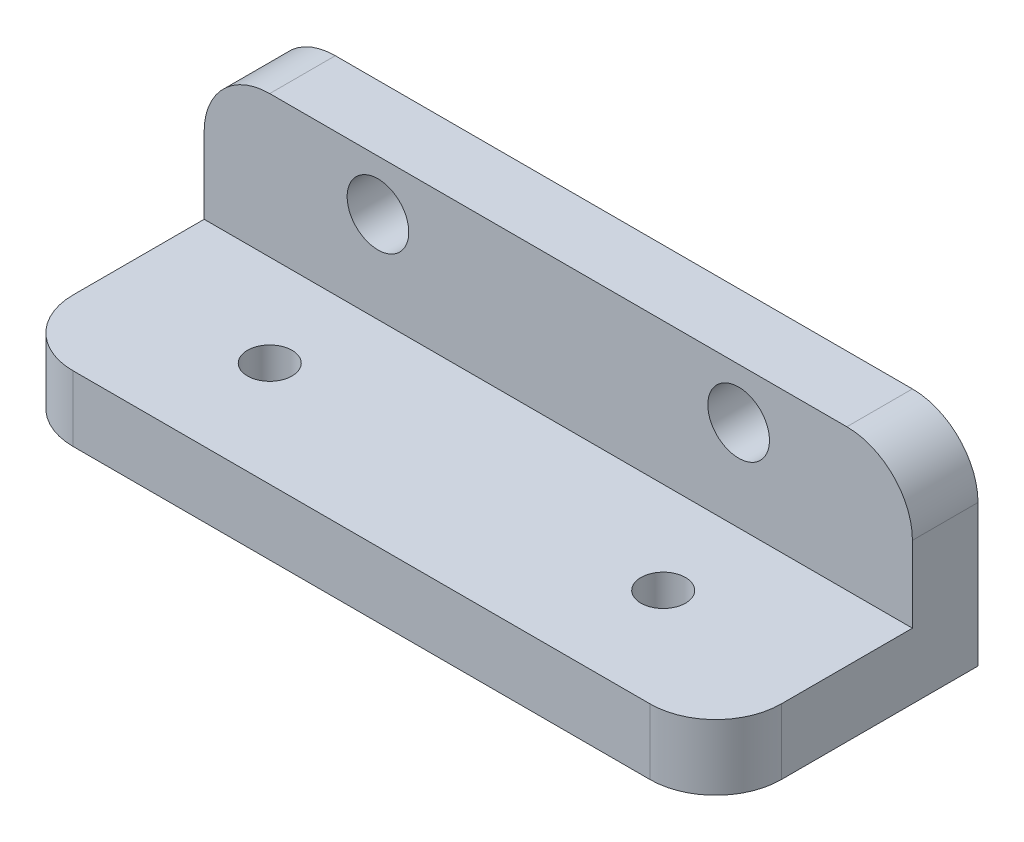
ISO-10303-21;
HEADER;
FILE_DESCRIPTION(('STEP AP214'),'2;1');
FILE_NAME('part.step','',(''),(''),'','','');
FILE_SCHEMA(('AUTOMOTIVE_DESIGN { 1 0 10303 214 1 1 1 1 }'));
ENDSEC;
DATA;
#1=APPLICATION_CONTEXT('core data for automotive mechanical design processes');
#2=APPLICATION_PROTOCOL_DEFINITION('international standard','automotive_design',2000,#1);
#3=PRODUCT_CONTEXT('',#1,'mechanical');
#4=PRODUCT('Part','Part','',(#3));
#5=PRODUCT_RELATED_PRODUCT_CATEGORY('part','',(#4));
#6=PRODUCT_DEFINITION_FORMATION('','',#4);
#7=PRODUCT_DEFINITION_CONTEXT('part definition',#1,'design');
#8=PRODUCT_DEFINITION('design','',#6,#7);
#9=PRODUCT_DEFINITION_SHAPE('','',#8);
#10=(LENGTH_UNIT() NAMED_UNIT(*) SI_UNIT(.MILLI.,.METRE.));
#11=(NAMED_UNIT(*) PLANE_ANGLE_UNIT() SI_UNIT($,.RADIAN.));
#12=(NAMED_UNIT(*) SI_UNIT($,.STERADIAN.) SOLID_ANGLE_UNIT());
#13=UNCERTAINTY_MEASURE_WITH_UNIT(LENGTH_MEASURE(1.E-05),#10,'distance_accuracy_value','');
#14=(GEOMETRIC_REPRESENTATION_CONTEXT(3) GLOBAL_UNCERTAINTY_ASSIGNED_CONTEXT((#13)) GLOBAL_UNIT_ASSIGNED_CONTEXT((#10,
#11,#12)) REPRESENTATION_CONTEXT('',''));
#15=CARTESIAN_POINT('',(0.,0.,0.));
#16=DIRECTION('',(0.,0.,1.));
#17=DIRECTION('',(1.,0.,0.));
#18=AXIS2_PLACEMENT_3D('',#15,#16,#17);
#19=CARTESIAN_POINT('',(-27.,5.,10.));
#20=DIRECTION('',(1.,0.,0.));
#21=DIRECTION('',(0.,0.,-1.));
#22=AXIS2_PLACEMENT_3D('',#19,#20,#21);
#23=PLANE('',#22);
#24=DIRECTION('',(0.,0.,1.));
#25=VECTOR('',#24,1.);
#26=CARTESIAN_POINT('',(-27.,0.,10.));
#27=LINE('',#26,#25);
#28=CARTESIAN_POINT('',(-27.,0.,-10.));
#29=VERTEX_POINT('',#28);
#30=CARTESIAN_POINT('',(-27.,0.,5.));
#31=VERTEX_POINT('',#30);
#32=EDGE_CURVE('E163',#29,#31,#27,.T.);
#33=ORIENTED_EDGE('',*,*,#32,.T.);
#34=DIRECTION('',(0.,-1.,0.));
#35=VECTOR('',#34,1.);
#36=CARTESIAN_POINT('',(-27.,5.,5.));
#37=LINE('',#36,#35);
#38=CARTESIAN_POINT('',(-27.,5.,5.));
#39=VERTEX_POINT('',#38);
#40=EDGE_CURVE('E186',#31,#39,#37,.F.);
#41=ORIENTED_EDGE('',*,*,#40,.T.);
#42=DIRECTION('',(0.,0.,1.));
#43=VECTOR('',#42,1.);
#44=CARTESIAN_POINT('',(-27.,5.,10.));
#45=LINE('',#44,#43);
#46=CARTESIAN_POINT('',(-27.,5.,-5.));
#47=VERTEX_POINT('',#46);
#48=EDGE_CURVE('E151',#47,#39,#45,.T.);
#49=ORIENTED_EDGE('',*,*,#48,.F.);
#50=DIRECTION('',(0.,-1.,0.));
#51=VECTOR('',#50,1.);
#52=CARTESIAN_POINT('',(-27.,15.8,-5.));
#53=LINE('',#52,#51);
#54=CARTESIAN_POINT('',(-27.,10.8,-5.));
#55=VERTEX_POINT('',#54);
#56=EDGE_CURVE('E135',#55,#47,#53,.T.);
#57=ORIENTED_EDGE('',*,*,#56,.F.);
#58=DIRECTION('',(0.,0.,1.));
#59=VECTOR('',#58,1.);
#60=CARTESIAN_POINT('',(-27.,10.8,-10.));
#61=LINE('',#60,#59);
#62=CARTESIAN_POINT('',(-27.,10.8,-10.));
#63=VERTEX_POINT('',#62);
#64=EDGE_CURVE('E182',#55,#63,#61,.F.);
#65=ORIENTED_EDGE('',*,*,#64,.T.);
#66=DIRECTION('',(0.,-1.,0.));
#67=VECTOR('',#66,1.);
#68=CARTESIAN_POINT('',(-27.,5.,-10.));
#69=LINE('',#68,#67);
#70=EDGE_CURVE('E125',#63,#29,#69,.T.);
#71=ORIENTED_EDGE('',*,*,#70,.T.);
#72=EDGE_LOOP('',(#33,#41,#49,#57,#65,#71));
#73=FACE_BOUND('',#72,.T.);
#74=ADVANCED_FACE('F33',(#73),#23,.F.);
#75=CARTESIAN_POINT('',(27.,5.,10.));
#76=DIRECTION('',(0.,0.,-1.));
#77=DIRECTION('',(-1.,0.,0.));
#78=AXIS2_PLACEMENT_3D('',#75,#76,#77);
#79=PLANE('',#78);
#80=DIRECTION('',(1.,0.,0.));
#81=VECTOR('',#80,1.);
#82=CARTESIAN_POINT('',(27.,0.,10.));
#83=LINE('',#82,#81);
#84=CARTESIAN_POINT('',(-22.,0.,10.));
#85=VERTEX_POINT('',#84);
#86=CARTESIAN_POINT('',(22.,0.,10.));
#87=VERTEX_POINT('',#86);
#88=EDGE_CURVE('E245',#85,#87,#83,.T.);
#89=ORIENTED_EDGE('',*,*,#88,.T.);
#90=DIRECTION('',(0.,-1.,0.));
#91=VECTOR('',#90,1.);
#92=CARTESIAN_POINT('',(22.,5.,10.));
#93=LINE('',#92,#91);
#94=CARTESIAN_POINT('',(22.,5.,10.));
#95=VERTEX_POINT('',#94);
#96=EDGE_CURVE('E177',#87,#95,#93,.F.);
#97=ORIENTED_EDGE('',*,*,#96,.T.);
#98=DIRECTION('',(1.,0.,0.));
#99=VECTOR('',#98,1.);
#100=CARTESIAN_POINT('',(27.,5.,10.));
#101=LINE('',#100,#99);
#102=CARTESIAN_POINT('',(-22.,5.,10.));
#103=VERTEX_POINT('',#102);
#104=EDGE_CURVE('E126',#103,#95,#101,.T.);
#105=ORIENTED_EDGE('',*,*,#104,.F.);
#106=DIRECTION('',(0.,-1.,0.));
#107=VECTOR('',#106,1.);
#108=CARTESIAN_POINT('',(-22.,5.,10.));
#109=LINE('',#108,#107);
#110=EDGE_CURVE('E174',#103,#85,#109,.T.);
#111=ORIENTED_EDGE('',*,*,#110,.T.);
#112=EDGE_LOOP('',(#89,#97,#105,#111));
#113=FACE_BOUND('',#112,.T.);
#114=ADVANCED_FACE('F220',(#113),#79,.F.);
#115=CARTESIAN_POINT('',(27.,5.,10.));
#116=DIRECTION('',(-1.,0.,0.));
#117=DIRECTION('',(0.,0.,1.));
#118=AXIS2_PLACEMENT_3D('',#115,#116,#117);
#119=PLANE('',#118);
#120=DIRECTION('',(0.,0.,-1.));
#121=VECTOR('',#120,1.);
#122=CARTESIAN_POINT('',(27.,5.,10.));
#123=LINE('',#122,#121);
#124=CARTESIAN_POINT('',(27.,5.,5.));
#125=VERTEX_POINT('',#124);
#126=CARTESIAN_POINT('',(27.,5.,-5.));
#127=VERTEX_POINT('',#126);
#128=EDGE_CURVE('E112',#125,#127,#123,.T.);
#129=ORIENTED_EDGE('',*,*,#128,.F.);
#130=DIRECTION('',(0.,-1.,0.));
#131=VECTOR('',#130,1.);
#132=CARTESIAN_POINT('',(27.,5.,5.));
#133=LINE('',#132,#131);
#134=CARTESIAN_POINT('',(27.,0.,5.));
#135=VERTEX_POINT('',#134);
#136=EDGE_CURVE('E167',#125,#135,#133,.T.);
#137=ORIENTED_EDGE('',*,*,#136,.T.);
#138=DIRECTION('',(0.,0.,-1.));
#139=VECTOR('',#138,1.);
#140=CARTESIAN_POINT('',(27.,0.,10.));
#141=LINE('',#140,#139);
#142=CARTESIAN_POINT('',(27.,0.,-10.));
#143=VERTEX_POINT('',#142);
#144=EDGE_CURVE('E206',#135,#143,#141,.T.);
#145=ORIENTED_EDGE('',*,*,#144,.T.);
#146=DIRECTION('',(0.,-1.,0.));
#147=VECTOR('',#146,1.);
#148=CARTESIAN_POINT('',(27.,5.,-10.));
#149=LINE('',#148,#147);
#150=CARTESIAN_POINT('',(27.,10.8,-10.));
#151=VERTEX_POINT('',#150);
#152=EDGE_CURVE('E168',#151,#143,#149,.T.);
#153=ORIENTED_EDGE('',*,*,#152,.F.);
#154=DIRECTION('',(0.,0.,-1.));
#155=VECTOR('',#154,1.);
#156=CARTESIAN_POINT('',(27.,10.8,-5.));
#157=LINE('',#156,#155);
#158=CARTESIAN_POINT('',(27.,10.8,-5.));
#159=VERTEX_POINT('',#158);
#160=EDGE_CURVE('E132',#151,#159,#157,.F.);
#161=ORIENTED_EDGE('',*,*,#160,.T.);
#162=DIRECTION('',(0.,-1.,0.));
#163=VECTOR('',#162,1.);
#164=CARTESIAN_POINT('',(27.,15.8,-5.));
#165=LINE('',#164,#163);
#166=EDGE_CURVE('E129',#159,#127,#165,.T.);
#167=ORIENTED_EDGE('',*,*,#166,.T.);
#168=EDGE_LOOP('',(#129,#137,#145,#153,#161,#167));
#169=FACE_BOUND('',#168,.T.);
#170=ADVANCED_FACE('F130',(#169),#119,.F.);
#171=CARTESIAN_POINT('',(27.,5.,-10.));
#172=DIRECTION('',(0.,0.,1.));
#173=DIRECTION('',(1.,0.,0.));
#174=AXIS2_PLACEMENT_3D('',#171,#172,#173);
#175=PLANE('',#174);
#176=CARTESIAN_POINT('',(-13.75,11.95,-10.));
#177=DIRECTION('',(0.,0.,-1.));
#178=DIRECTION('',(-1.,0.,0.));
#179=AXIS2_PLACEMENT_3D('',#176,#177,#178);
#180=CIRCLE('',#179,2.35);
#181=CARTESIAN_POINT('',(-16.1,11.95,-10.));
#182=VERTEX_POINT('',#181);
#183=EDGE_CURVE('E400',#182,#182,#180,.T.);
#184=ORIENTED_EDGE('',*,*,#183,.F.);
#185=EDGE_LOOP('',(#184));
#186=FACE_BOUND('',#185,.T.);
#187=CARTESIAN_POINT('',(13.75,11.95,-10.));
#188=DIRECTION('',(0.,0.,-1.));
#189=DIRECTION('',(-1.,0.,0.));
#190=AXIS2_PLACEMENT_3D('',#187,#188,#189);
#191=CIRCLE('',#190,2.35);
#192=CARTESIAN_POINT('',(11.4,11.95,-10.));
#193=VERTEX_POINT('',#192);
#194=EDGE_CURVE('E394',#193,#193,#191,.T.);
#195=ORIENTED_EDGE('',*,*,#194,.F.);
#196=EDGE_LOOP('',(#195));
#197=FACE_BOUND('',#196,.T.);
#198=DIRECTION('',(-1.,0.,0.));
#199=VECTOR('',#198,1.);
#200=CARTESIAN_POINT('',(-27.,15.8,-10.));
#201=LINE('',#200,#199);
#202=CARTESIAN_POINT('',(22.,15.8,-10.));
#203=VERTEX_POINT('',#202);
#204=CARTESIAN_POINT('',(-22.,15.8,-10.));
#205=VERTEX_POINT('',#204);
#206=EDGE_CURVE('E136',#203,#205,#201,.T.);
#207=ORIENTED_EDGE('',*,*,#206,.F.);
#208=CARTESIAN_POINT('',(22.,10.8,-10.));
#209=DIRECTION('',(0.,0.,1.));
#210=DIRECTION('',(1.,0.,0.));
#211=AXIS2_PLACEMENT_3D('',#208,#209,#210);
#212=CIRCLE('',#211,5.);
#213=EDGE_CURVE('E56',#203,#151,#212,.F.);
#214=ORIENTED_EDGE('',*,*,#213,.T.);
#215=ORIENTED_EDGE('',*,*,#152,.T.);
#216=DIRECTION('',(-1.,0.,0.));
#217=VECTOR('',#216,1.);
#218=CARTESIAN_POINT('',(27.,0.,-10.));
#219=LINE('',#218,#217);
#220=EDGE_CURVE('E244',#143,#29,#219,.T.);
#221=ORIENTED_EDGE('',*,*,#220,.T.);
#222=ORIENTED_EDGE('',*,*,#70,.F.);
#223=CARTESIAN_POINT('',(-22.,10.8,-10.));
#224=DIRECTION('',(0.,0.,1.));
#225=DIRECTION('',(1.,0.,0.));
#226=AXIS2_PLACEMENT_3D('',#223,#224,#225);
#227=CIRCLE('',#226,5.);
#228=EDGE_CURVE('E48',#63,#205,#227,.F.);
#229=ORIENTED_EDGE('',*,*,#228,.T.);
#230=EDGE_LOOP('',(#207,#214,#215,#221,#222,#229));
#231=FACE_BOUND('',#230,.T.);
#232=ADVANCED_FACE('F202',(#186,#197,#231),#175,.F.);
#233=CARTESIAN_POINT('',(0.,5.,0.));
#234=DIRECTION('',(0.,1.,0.));
#235=DIRECTION('',(0.,0.,1.));
#236=AXIS2_PLACEMENT_3D('',#233,#234,#235);
#237=PLANE('',#236);
#238=CARTESIAN_POINT('',(15.,5.,2.));
#239=DIRECTION('',(0.,1.,0.));
#240=DIRECTION('',(0.,0.,1.));
#241=AXIS2_PLACEMENT_3D('',#238,#239,#240);
#242=CIRCLE('',#241,1.69999999999999);
#243=CARTESIAN_POINT('',(15.,5.,3.69999999999999));
#244=VERTEX_POINT('',#243);
#245=EDGE_CURVE('E386',#244,#244,#242,.T.);
#246=ORIENTED_EDGE('',*,*,#245,.F.);
#247=EDGE_LOOP('',(#246));
#248=FACE_BOUND('',#247,.T.);
#249=CARTESIAN_POINT('',(-15.,5.,2.));
#250=DIRECTION('',(0.,1.,0.));
#251=DIRECTION('',(0.,0.,1.));
#252=AXIS2_PLACEMENT_3D('',#249,#250,#251);
#253=CIRCLE('',#252,1.69999999999999);
#254=CARTESIAN_POINT('',(-15.,5.,3.69999999999999));
#255=VERTEX_POINT('',#254);
#256=EDGE_CURVE('E146',#255,#255,#253,.T.);
#257=ORIENTED_EDGE('',*,*,#256,.F.);
#258=EDGE_LOOP('',(#257));
#259=FACE_BOUND('',#258,.T.);
#260=ORIENTED_EDGE('',*,*,#104,.T.);
#261=CARTESIAN_POINT('',(22.,5.,5.));
#262=DIRECTION('',(0.,1.,0.));
#263=DIRECTION('',(0.,0.,1.));
#264=AXIS2_PLACEMENT_3D('',#261,#262,#263);
#265=CIRCLE('',#264,5.);
#266=EDGE_CURVE('E121',#95,#125,#265,.T.);
#267=ORIENTED_EDGE('',*,*,#266,.T.);
#268=ORIENTED_EDGE('',*,*,#128,.T.);
#269=DIRECTION('',(1.,0.,0.));
#270=VECTOR('',#269,1.);
#271=CARTESIAN_POINT('',(-27.,5.,-5.));
#272=LINE('',#271,#270);
#273=EDGE_CURVE('E118',#47,#127,#272,.T.);
#274=ORIENTED_EDGE('',*,*,#273,.F.);
#275=ORIENTED_EDGE('',*,*,#48,.T.);
#276=CARTESIAN_POINT('',(-22.,5.,5.));
#277=DIRECTION('',(0.,1.,0.));
#278=DIRECTION('',(0.,0.,1.));
#279=AXIS2_PLACEMENT_3D('',#276,#277,#278);
#280=CIRCLE('',#279,5.);
#281=EDGE_CURVE('E179',#39,#103,#280,.T.);
#282=ORIENTED_EDGE('',*,*,#281,.T.);
#283=EDGE_LOOP('',(#260,#267,#268,#274,#275,#282));
#284=FACE_BOUND('',#283,.T.);
#285=ADVANCED_FACE('F115',(#248,#259,#284),#237,.T.);
#286=CARTESIAN_POINT('',(0.,0.,0.));
#287=DIRECTION('',(0.,1.,0.));
#288=DIRECTION('',(0.,0.,1.));
#289=AXIS2_PLACEMENT_3D('',#286,#287,#288);
#290=PLANE('',#289);
#291=CARTESIAN_POINT('',(15.,0.,2.));
#292=DIRECTION('',(0.,1.,0.));
#293=DIRECTION('',(0.,0.,1.));
#294=AXIS2_PLACEMENT_3D('',#291,#292,#293);
#295=CIRCLE('',#294,1.7);
#296=CARTESIAN_POINT('',(15.,0.,3.7));
#297=VERTEX_POINT('',#296);
#298=EDGE_CURVE('E384',#297,#297,#295,.T.);
#299=ORIENTED_EDGE('',*,*,#298,.T.);
#300=EDGE_LOOP('',(#299));
#301=FACE_BOUND('',#300,.T.);
#302=CARTESIAN_POINT('',(-15.,0.,2.));
#303=DIRECTION('',(0.,1.,0.));
#304=DIRECTION('',(0.,0.,1.));
#305=AXIS2_PLACEMENT_3D('',#302,#303,#304);
#306=CIRCLE('',#305,1.7);
#307=CARTESIAN_POINT('',(-15.,0.,3.7));
#308=VERTEX_POINT('',#307);
#309=EDGE_CURVE('E141',#308,#308,#306,.T.);
#310=ORIENTED_EDGE('',*,*,#309,.T.);
#311=EDGE_LOOP('',(#310));
#312=FACE_BOUND('',#311,.T.);
#313=ORIENTED_EDGE('',*,*,#144,.F.);
#314=CARTESIAN_POINT('',(22.,0.,5.));
#315=DIRECTION('',(0.,1.,0.));
#316=DIRECTION('',(0.,0.,1.));
#317=AXIS2_PLACEMENT_3D('',#314,#315,#316);
#318=CIRCLE('',#317,5.);
#319=EDGE_CURVE('E172',#135,#87,#318,.F.);
#320=ORIENTED_EDGE('',*,*,#319,.T.);
#321=ORIENTED_EDGE('',*,*,#88,.F.);
#322=CARTESIAN_POINT('',(-22.,0.,5.));
#323=DIRECTION('',(0.,1.,0.));
#324=DIRECTION('',(0.,0.,1.));
#325=AXIS2_PLACEMENT_3D('',#322,#323,#324);
#326=CIRCLE('',#325,5.);
#327=EDGE_CURVE('E170',#85,#31,#326,.F.);
#328=ORIENTED_EDGE('',*,*,#327,.T.);
#329=ORIENTED_EDGE('',*,*,#32,.F.);
#330=ORIENTED_EDGE('',*,*,#220,.F.);
#331=EDGE_LOOP('',(#313,#320,#321,#328,#329,#330));
#332=FACE_BOUND('',#331,.T.);
#333=ADVANCED_FACE('F240',(#301,#312,#332),#290,.F.);
#334=CARTESIAN_POINT('',(-27.,15.8,-5.));
#335=DIRECTION('',(0.,0.,-1.));
#336=DIRECTION('',(-1.,0.,0.));
#337=AXIS2_PLACEMENT_3D('',#334,#335,#336);
#338=PLANE('',#337);
#339=CARTESIAN_POINT('',(-13.75,11.95,-5.));
#340=DIRECTION('',(0.,0.,-1.));
#341=DIRECTION('',(-1.,0.,0.));
#342=AXIS2_PLACEMENT_3D('',#339,#340,#341);
#343=CIRCLE('',#342,2.35);
#344=CARTESIAN_POINT('',(-16.1,11.95,-5.));
#345=VERTEX_POINT('',#344);
#346=EDGE_CURVE('E397',#345,#345,#343,.T.);
#347=ORIENTED_EDGE('',*,*,#346,.T.);
#348=EDGE_LOOP('',(#347));
#349=FACE_BOUND('',#348,.T.);
#350=CARTESIAN_POINT('',(13.75,11.95,-5.));
#351=DIRECTION('',(0.,0.,-1.));
#352=DIRECTION('',(-1.,0.,0.));
#353=AXIS2_PLACEMENT_3D('',#350,#351,#352);
#354=CIRCLE('',#353,2.35);
#355=CARTESIAN_POINT('',(11.4,11.95,-5.));
#356=VERTEX_POINT('',#355);
#357=EDGE_CURVE('E391',#356,#356,#354,.T.);
#358=ORIENTED_EDGE('',*,*,#357,.T.);
#359=EDGE_LOOP('',(#358));
#360=FACE_BOUND('',#359,.T.);
#361=ORIENTED_EDGE('',*,*,#166,.F.);
#362=CARTESIAN_POINT('',(22.,10.8,-5.));
#363=DIRECTION('',(0.,0.,-1.));
#364=DIRECTION('',(-1.,0.,0.));
#365=AXIS2_PLACEMENT_3D('',#362,#363,#364);
#366=CIRCLE('',#365,5.);
#367=CARTESIAN_POINT('',(22.,15.8,-5.));
#368=VERTEX_POINT('',#367);
#369=EDGE_CURVE('E11',#159,#368,#366,.F.);
#370=ORIENTED_EDGE('',*,*,#369,.T.);
#371=DIRECTION('',(1.,0.,0.));
#372=VECTOR('',#371,1.);
#373=CARTESIAN_POINT('',(-27.,15.8,-5.));
#374=LINE('',#373,#372);
#375=CARTESIAN_POINT('',(-22.,15.8,-5.));
#376=VERTEX_POINT('',#375);
#377=EDGE_CURVE('E140',#376,#368,#374,.T.);
#378=ORIENTED_EDGE('',*,*,#377,.F.);
#379=CARTESIAN_POINT('',(-22.,10.8,-5.));
#380=DIRECTION('',(0.,0.,-1.));
#381=DIRECTION('',(-1.,0.,0.));
#382=AXIS2_PLACEMENT_3D('',#379,#380,#381);
#383=CIRCLE('',#382,5.);
#384=EDGE_CURVE('E41',#376,#55,#383,.F.);
#385=ORIENTED_EDGE('',*,*,#384,.T.);
#386=ORIENTED_EDGE('',*,*,#56,.T.);
#387=ORIENTED_EDGE('',*,*,#273,.T.);
#388=EDGE_LOOP('',(#361,#370,#378,#385,#386,#387));
#389=FACE_BOUND('',#388,.T.);
#390=ADVANCED_FACE('F138',(#349,#360,#389),#338,.F.);
#391=CARTESIAN_POINT('',(0.,15.8,0.));
#392=DIRECTION('',(0.,1.,0.));
#393=DIRECTION('',(0.,0.,1.));
#394=AXIS2_PLACEMENT_3D('',#391,#392,#393);
#395=PLANE('',#394);
#396=ORIENTED_EDGE('',*,*,#377,.T.);
#397=DIRECTION('',(0.,0.,-1.));
#398=VECTOR('',#397,1.);
#399=CARTESIAN_POINT('',(22.,15.8,-10.));
#400=LINE('',#399,#398);
#401=EDGE_CURVE('E191',#368,#203,#400,.T.);
#402=ORIENTED_EDGE('',*,*,#401,.T.);
#403=ORIENTED_EDGE('',*,*,#206,.T.);
#404=DIRECTION('',(0.,0.,1.));
#405=VECTOR('',#404,1.);
#406=CARTESIAN_POINT('',(-22.,15.8,-5.));
#407=LINE('',#406,#405);
#408=EDGE_CURVE('E188',#205,#376,#407,.T.);
#409=ORIENTED_EDGE('',*,*,#408,.T.);
#410=EDGE_LOOP('',(#396,#402,#403,#409));
#411=FACE_BOUND('',#410,.T.);
#412=ADVANCED_FACE('F201',(#411),#395,.T.);
#413=CARTESIAN_POINT('',(-15.,5.,2.));
#414=DIRECTION('',(0.,1.,0.));
#415=DIRECTION('',(0.,0.,1.));
#416=AXIS2_PLACEMENT_3D('',#413,#414,#415);
#417=CYLINDRICAL_SURFACE('',#416,1.69999999999999);
#418=ORIENTED_EDGE('',*,*,#309,.F.);
#419=EDGE_LOOP('',(#418));
#420=FACE_BOUND('',#419,.T.);
#421=ORIENTED_EDGE('',*,*,#256,.T.);
#422=EDGE_LOOP('',(#421));
#423=FACE_BOUND('',#422,.T.);
#424=ADVANCED_FACE('F235',(#420,#423),#417,.F.);
#425=CARTESIAN_POINT('',(15.,5.,2.));
#426=DIRECTION('',(0.,1.,0.));
#427=DIRECTION('',(0.,0.,1.));
#428=AXIS2_PLACEMENT_3D('',#425,#426,#427);
#429=CYLINDRICAL_SURFACE('',#428,1.69999999999999);
#430=ORIENTED_EDGE('',*,*,#298,.F.);
#431=EDGE_LOOP('',(#430));
#432=FACE_BOUND('',#431,.T.);
#433=ORIENTED_EDGE('',*,*,#245,.T.);
#434=EDGE_LOOP('',(#433));
#435=FACE_BOUND('',#434,.T.);
#436=ADVANCED_FACE('F230',(#432,#435),#429,.F.);
#437=CARTESIAN_POINT('',(22.,5.,5.));
#438=DIRECTION('',(0.,-1.,0.));
#439=DIRECTION('',(0.,0.,-1.));
#440=AXIS2_PLACEMENT_3D('',#437,#438,#439);
#441=CYLINDRICAL_SURFACE('',#440,5.);
#442=ORIENTED_EDGE('',*,*,#266,.F.);
#443=ORIENTED_EDGE('',*,*,#96,.F.);
#444=ORIENTED_EDGE('',*,*,#319,.F.);
#445=ORIENTED_EDGE('',*,*,#136,.F.);
#446=EDGE_LOOP('',(#442,#443,#444,#445));
#447=FACE_BOUND('',#446,.T.);
#448=ADVANCED_FACE('F216',(#447),#441,.T.);
#449=CARTESIAN_POINT('',(-22.,5.,5.));
#450=DIRECTION('',(0.,-1.,0.));
#451=DIRECTION('',(0.,0.,-1.));
#452=AXIS2_PLACEMENT_3D('',#449,#450,#451);
#453=CYLINDRICAL_SURFACE('',#452,5.);
#454=ORIENTED_EDGE('',*,*,#281,.F.);
#455=ORIENTED_EDGE('',*,*,#40,.F.);
#456=ORIENTED_EDGE('',*,*,#327,.F.);
#457=ORIENTED_EDGE('',*,*,#110,.F.);
#458=EDGE_LOOP('',(#454,#455,#456,#457));
#459=FACE_BOUND('',#458,.T.);
#460=ADVANCED_FACE('F210',(#459),#453,.T.);
#461=CARTESIAN_POINT('',(22.,10.8,0.));
#462=DIRECTION('',(0.,0.,1.));
#463=DIRECTION('',(1.,0.,0.));
#464=AXIS2_PLACEMENT_3D('',#461,#462,#463);
#465=CYLINDRICAL_SURFACE('',#464,5.);
#466=ORIENTED_EDGE('',*,*,#369,.F.);
#467=ORIENTED_EDGE('',*,*,#160,.F.);
#468=ORIENTED_EDGE('',*,*,#213,.F.);
#469=ORIENTED_EDGE('',*,*,#401,.F.);
#470=EDGE_LOOP('',(#466,#467,#468,#469));
#471=FACE_BOUND('',#470,.T.);
#472=ADVANCED_FACE('F208',(#471),#465,.T.);
#473=CARTESIAN_POINT('',(-22.,10.8,0.));
#474=DIRECTION('',(0.,0.,-1.));
#475=DIRECTION('',(-1.,0.,0.));
#476=AXIS2_PLACEMENT_3D('',#473,#474,#475);
#477=CYLINDRICAL_SURFACE('',#476,5.);
#478=ORIENTED_EDGE('',*,*,#228,.F.);
#479=ORIENTED_EDGE('',*,*,#64,.F.);
#480=ORIENTED_EDGE('',*,*,#384,.F.);
#481=ORIENTED_EDGE('',*,*,#408,.F.);
#482=EDGE_LOOP('',(#478,#479,#480,#481));
#483=FACE_BOUND('',#482,.T.);
#484=ADVANCED_FACE('F35',(#483),#477,.T.);
#485=CARTESIAN_POINT('',(13.75,11.95,-2.2));
#486=DIRECTION('',(0.,0.,-1.));
#487=DIRECTION('',(-1.,0.,0.));
#488=AXIS2_PLACEMENT_3D('',#485,#486,#487);
#489=CYLINDRICAL_SURFACE('',#488,2.35);
#490=ORIENTED_EDGE('',*,*,#194,.T.);
#491=EDGE_LOOP('',(#490));
#492=FACE_BOUND('',#491,.T.);
#493=ORIENTED_EDGE('',*,*,#357,.F.);
#494=EDGE_LOOP('',(#493));
#495=FACE_BOUND('',#494,.T.);
#496=ADVANCED_FACE('F215',(#492,#495),#489,.F.);
#497=CARTESIAN_POINT('',(-13.75,11.95,-2.2));
#498=DIRECTION('',(0.,0.,-1.));
#499=DIRECTION('',(-1.,0.,0.));
#500=AXIS2_PLACEMENT_3D('',#497,#498,#499);
#501=CYLINDRICAL_SURFACE('',#500,2.35);
#502=ORIENTED_EDGE('',*,*,#183,.T.);
#503=EDGE_LOOP('',(#502));
#504=FACE_BOUND('',#503,.T.);
#505=ORIENTED_EDGE('',*,*,#346,.F.);
#506=EDGE_LOOP('',(#505));
#507=FACE_BOUND('',#506,.T.);
#508=ADVANCED_FACE('F329',(#504,#507),#501,.F.);
#509=CLOSED_SHELL('',(#74,#114,#170,#232,#285,#333,#390,#412,#424,#436,#448,#460,#472,#484,#496,#508));
#510=MANIFOLD_SOLID_BREP('B2',#509);
#511=ADVANCED_BREP_SHAPE_REPRESENTATION('',(#18,#510),#14);
#512=SHAPE_DEFINITION_REPRESENTATION(#9,#511);
ENDSEC;
END-ISO-10303-21;
